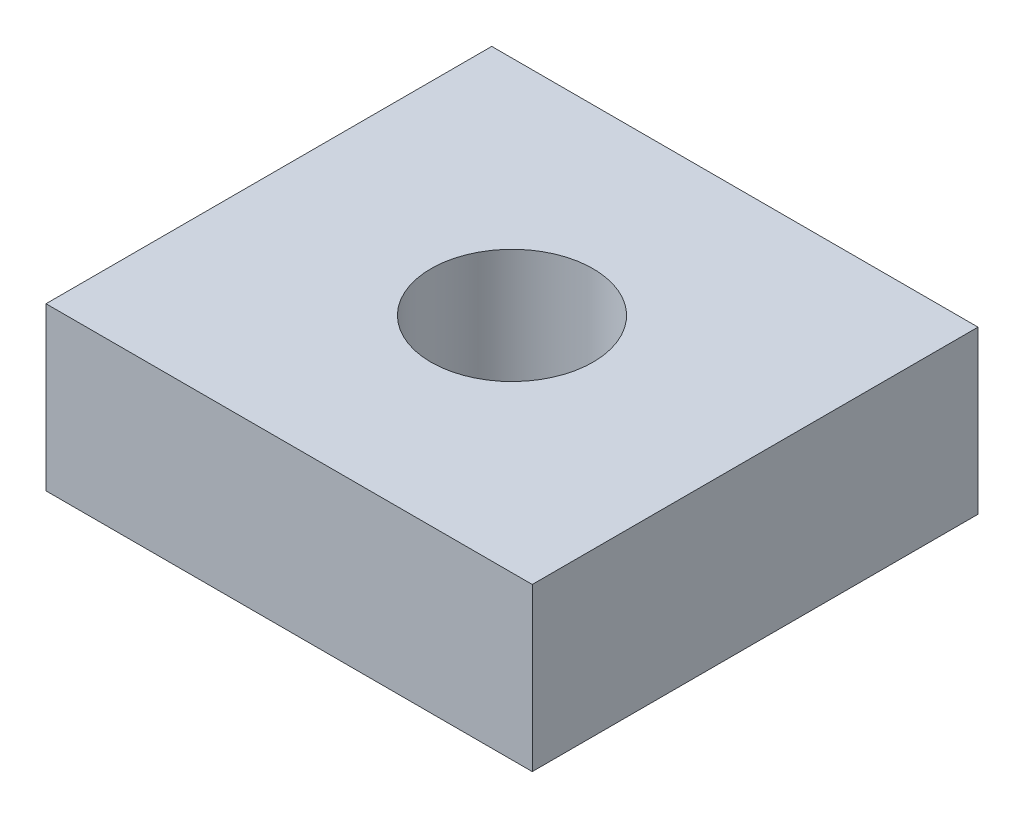
ISO-10303-21;
HEADER;
FILE_DESCRIPTION(('STEP AP214'),'2;1');
FILE_NAME('part.step','',(''),(''),'','','');
FILE_SCHEMA(('AUTOMOTIVE_DESIGN { 1 0 10303 214 1 1 1 1 }'));
ENDSEC;
DATA;
#1=APPLICATION_CONTEXT('core data for automotive mechanical design processes');
#2=APPLICATION_PROTOCOL_DEFINITION('international standard','automotive_design',2000,#1);
#3=PRODUCT_CONTEXT('',#1,'mechanical');
#4=PRODUCT('Part','Part','',(#3));
#5=PRODUCT_RELATED_PRODUCT_CATEGORY('part','',(#4));
#6=PRODUCT_DEFINITION_FORMATION('','',#4);
#7=PRODUCT_DEFINITION_CONTEXT('part definition',#1,'design');
#8=PRODUCT_DEFINITION('design','',#6,#7);
#9=PRODUCT_DEFINITION_SHAPE('','',#8);
#10=(LENGTH_UNIT() NAMED_UNIT(*) SI_UNIT(.MILLI.,.METRE.));
#11=(NAMED_UNIT(*) PLANE_ANGLE_UNIT() SI_UNIT($,.RADIAN.));
#12=(NAMED_UNIT(*) SI_UNIT($,.STERADIAN.) SOLID_ANGLE_UNIT());
#13=UNCERTAINTY_MEASURE_WITH_UNIT(LENGTH_MEASURE(1.E-05),#10,'distance_accuracy_value','');
#14=(GEOMETRIC_REPRESENTATION_CONTEXT(3) GLOBAL_UNCERTAINTY_ASSIGNED_CONTEXT((#13)) GLOBAL_UNIT_ASSIGNED_CONTEXT((#10,
#11,#12)) REPRESENTATION_CONTEXT('',''));
#15=CARTESIAN_POINT('',(0.,0.,0.));
#16=DIRECTION('',(0.,0.,1.));
#17=DIRECTION('',(1.,0.,0.));
#18=AXIS2_PLACEMENT_3D('',#15,#16,#17);
#19=CARTESIAN_POINT('',(38.1,25.4,34.925));
#20=DIRECTION('',(-1.,0.,0.));
#21=DIRECTION('',(0.,0.,1.));
#22=AXIS2_PLACEMENT_3D('',#19,#20,#21);
#23=PLANE('',#22);
#24=DIRECTION('',(0.,0.,-1.));
#25=VECTOR('',#24,1.);
#26=CARTESIAN_POINT('',(38.1,0.,34.925));
#27=LINE('',#26,#25);
#28=CARTESIAN_POINT('',(38.1,0.,34.925));
#29=VERTEX_POINT('',#28);
#30=CARTESIAN_POINT('',(38.1,0.,-34.925));
#31=VERTEX_POINT('',#30);
#32=EDGE_CURVE('E107',#29,#31,#27,.T.);
#33=ORIENTED_EDGE('',*,*,#32,.T.);
#34=DIRECTION('',(0.,-1.,0.));
#35=VECTOR('',#34,1.);
#36=CARTESIAN_POINT('',(38.1,25.4,-34.925));
#37=LINE('',#36,#35);
#38=CARTESIAN_POINT('',(38.1,25.4,-34.925));
#39=VERTEX_POINT('',#38);
#40=EDGE_CURVE('E11',#39,#31,#37,.T.);
#41=ORIENTED_EDGE('',*,*,#40,.F.);
#42=DIRECTION('',(0.,0.,-1.));
#43=VECTOR('',#42,1.);
#44=CARTESIAN_POINT('',(38.1,25.4,34.925));
#45=LINE('',#44,#43);
#46=CARTESIAN_POINT('',(38.1,25.4,34.925));
#47=VERTEX_POINT('',#46);
#48=EDGE_CURVE('E91',#47,#39,#45,.T.);
#49=ORIENTED_EDGE('',*,*,#48,.F.);
#50=DIRECTION('',(0.,-1.,0.));
#51=VECTOR('',#50,1.);
#52=CARTESIAN_POINT('',(38.1,25.4,34.925));
#53=LINE('',#52,#51);
#54=EDGE_CURVE('E103',#47,#29,#53,.T.);
#55=ORIENTED_EDGE('',*,*,#54,.T.);
#56=EDGE_LOOP('',(#33,#41,#49,#55));
#57=FACE_BOUND('',#56,.T.);
#58=ADVANCED_FACE('F39',(#57),#23,.F.);
#59=CARTESIAN_POINT('',(-38.1,25.4,-34.925));
#60=DIRECTION('',(0.,0.,1.));
#61=DIRECTION('',(1.,0.,0.));
#62=AXIS2_PLACEMENT_3D('',#59,#60,#61);
#63=PLANE('',#62);
#64=DIRECTION('',(-1.,0.,0.));
#65=VECTOR('',#64,1.);
#66=CARTESIAN_POINT('',(-38.1,0.,-34.925));
#67=LINE('',#66,#65);
#68=CARTESIAN_POINT('',(-38.1,0.,-34.925));
#69=VERTEX_POINT('',#68);
#70=EDGE_CURVE('E96',#31,#69,#67,.T.);
#71=ORIENTED_EDGE('',*,*,#70,.T.);
#72=DIRECTION('',(0.,-1.,0.));
#73=VECTOR('',#72,1.);
#74=CARTESIAN_POINT('',(-38.1,25.4,-34.925));
#75=LINE('',#74,#73);
#76=CARTESIAN_POINT('',(-38.1,25.4,-34.925));
#77=VERTEX_POINT('',#76);
#78=EDGE_CURVE('E48',#77,#69,#75,.T.);
#79=ORIENTED_EDGE('',*,*,#78,.F.);
#80=DIRECTION('',(-1.,0.,0.));
#81=VECTOR('',#80,1.);
#82=CARTESIAN_POINT('',(-38.1,25.4,-34.925));
#83=LINE('',#82,#81);
#84=EDGE_CURVE('E86',#39,#77,#83,.T.);
#85=ORIENTED_EDGE('',*,*,#84,.F.);
#86=ORIENTED_EDGE('',*,*,#40,.T.);
#87=EDGE_LOOP('',(#71,#79,#85,#86));
#88=FACE_BOUND('',#87,.T.);
#89=ADVANCED_FACE('F95',(#88),#63,.F.);
#90=CARTESIAN_POINT('',(-38.1,25.4,34.925));
#91=DIRECTION('',(1.,0.,0.));
#92=DIRECTION('',(0.,0.,-1.));
#93=AXIS2_PLACEMENT_3D('',#90,#91,#92);
#94=PLANE('',#93);
#95=DIRECTION('',(0.,0.,1.));
#96=VECTOR('',#95,1.);
#97=CARTESIAN_POINT('',(-38.1,0.,34.925));
#98=LINE('',#97,#96);
#99=CARTESIAN_POINT('',(-38.1,0.,34.925));
#100=VERTEX_POINT('',#99);
#101=EDGE_CURVE('E73',#69,#100,#98,.T.);
#102=ORIENTED_EDGE('',*,*,#101,.T.);
#103=DIRECTION('',(0.,-1.,0.));
#104=VECTOR('',#103,1.);
#105=CARTESIAN_POINT('',(-38.1,25.4,34.925));
#106=LINE('',#105,#104);
#107=CARTESIAN_POINT('',(-38.1,25.4,34.925));
#108=VERTEX_POINT('',#107);
#109=EDGE_CURVE('E98',#108,#100,#106,.T.);
#110=ORIENTED_EDGE('',*,*,#109,.F.);
#111=DIRECTION('',(0.,0.,1.));
#112=VECTOR('',#111,1.);
#113=CARTESIAN_POINT('',(-38.1,25.4,34.925));
#114=LINE('',#113,#112);
#115=EDGE_CURVE('E89',#77,#108,#114,.T.);
#116=ORIENTED_EDGE('',*,*,#115,.F.);
#117=ORIENTED_EDGE('',*,*,#78,.T.);
#118=EDGE_LOOP('',(#102,#110,#116,#117));
#119=FACE_BOUND('',#118,.T.);
#120=ADVANCED_FACE('F99',(#119),#94,.F.);
#121=CARTESIAN_POINT('',(-38.1,25.4,34.925));
#122=DIRECTION('',(0.,0.,-1.));
#123=DIRECTION('',(-1.,0.,0.));
#124=AXIS2_PLACEMENT_3D('',#121,#122,#123);
#125=PLANE('',#124);
#126=DIRECTION('',(1.,0.,0.));
#127=VECTOR('',#126,1.);
#128=CARTESIAN_POINT('',(-38.1,0.,34.925));
#129=LINE('',#128,#127);
#130=EDGE_CURVE('E79',#100,#29,#129,.T.);
#131=ORIENTED_EDGE('',*,*,#130,.T.);
#132=ORIENTED_EDGE('',*,*,#54,.F.);
#133=DIRECTION('',(1.,0.,0.));
#134=VECTOR('',#133,1.);
#135=CARTESIAN_POINT('',(-38.1,25.4,34.925));
#136=LINE('',#135,#134);
#137=EDGE_CURVE('E56',#108,#47,#136,.T.);
#138=ORIENTED_EDGE('',*,*,#137,.F.);
#139=ORIENTED_EDGE('',*,*,#109,.T.);
#140=EDGE_LOOP('',(#131,#132,#138,#139));
#141=FACE_BOUND('',#140,.T.);
#142=ADVANCED_FACE('F121',(#141),#125,.F.);
#143=CARTESIAN_POINT('',(0.,25.4,0.));
#144=DIRECTION('',(0.,-1.,0.));
#145=DIRECTION('',(0.,0.,-1.));
#146=AXIS2_PLACEMENT_3D('',#143,#144,#145);
#147=PLANE('',#146);
#148=CARTESIAN_POINT('',(0.,25.4,0.));
#149=DIRECTION('',(0.,1.,0.));
#150=DIRECTION('',(0.,0.,1.));
#151=AXIS2_PLACEMENT_3D('',#148,#149,#150);
#152=CIRCLE('',#151,12.7);
#153=CARTESIAN_POINT('',(0.,25.4,12.7));
#154=VERTEX_POINT('',#153);
#155=EDGE_CURVE('E128',#154,#154,#152,.T.);
#156=ORIENTED_EDGE('',*,*,#155,.F.);
#157=EDGE_LOOP('',(#156));
#158=FACE_BOUND('',#157,.T.);
#159=ORIENTED_EDGE('',*,*,#48,.T.);
#160=ORIENTED_EDGE('',*,*,#84,.T.);
#161=ORIENTED_EDGE('',*,*,#115,.T.);
#162=ORIENTED_EDGE('',*,*,#137,.T.);
#163=EDGE_LOOP('',(#159,#160,#161,#162));
#164=FACE_BOUND('',#163,.T.);
#165=ADVANCED_FACE('F87',(#158,#164),#147,.F.);
#166=CARTESIAN_POINT('',(0.,0.,0.));
#167=DIRECTION('',(0.,-1.,0.));
#168=DIRECTION('',(0.,0.,-1.));
#169=AXIS2_PLACEMENT_3D('',#166,#167,#168);
#170=PLANE('',#169);
#171=CARTESIAN_POINT('',(0.,0.,0.));
#172=DIRECTION('',(0.,1.,0.));
#173=DIRECTION('',(0.,0.,1.));
#174=AXIS2_PLACEMENT_3D('',#171,#172,#173);
#175=CIRCLE('',#174,12.7);
#176=CARTESIAN_POINT('',(0.,0.,12.7));
#177=VERTEX_POINT('',#176);
#178=EDGE_CURVE('E111',#177,#177,#175,.T.);
#179=ORIENTED_EDGE('',*,*,#178,.T.);
#180=EDGE_LOOP('',(#179));
#181=FACE_BOUND('',#180,.T.);
#182=ORIENTED_EDGE('',*,*,#32,.F.);
#183=ORIENTED_EDGE('',*,*,#130,.F.);
#184=ORIENTED_EDGE('',*,*,#101,.F.);
#185=ORIENTED_EDGE('',*,*,#70,.F.);
#186=EDGE_LOOP('',(#182,#183,#184,#185));
#187=FACE_BOUND('',#186,.T.);
#188=ADVANCED_FACE('F124',(#181,#187),#170,.T.);
#189=CARTESIAN_POINT('',(0.,0.,0.));
#190=DIRECTION('',(0.,1.,0.));
#191=DIRECTION('',(0.,0.,1.));
#192=AXIS2_PLACEMENT_3D('',#189,#190,#191);
#193=CYLINDRICAL_SURFACE('',#192,12.7);
#194=ORIENTED_EDGE('',*,*,#178,.F.);
#195=EDGE_LOOP('',(#194));
#196=FACE_BOUND('',#195,.T.);
#197=ORIENTED_EDGE('',*,*,#155,.T.);
#198=EDGE_LOOP('',(#197));
#199=FACE_BOUND('',#198,.T.);
#200=ADVANCED_FACE('F137',(#196,#199),#193,.F.);
#201=CLOSED_SHELL('',(#58,#89,#120,#142,#165,#188,#200));
#202=MANIFOLD_SOLID_BREP('B2',#201);
#203=ADVANCED_BREP_SHAPE_REPRESENTATION('',(#18,#202),#14);
#204=SHAPE_DEFINITION_REPRESENTATION(#9,#203);
ENDSEC;
END-ISO-10303-21;
